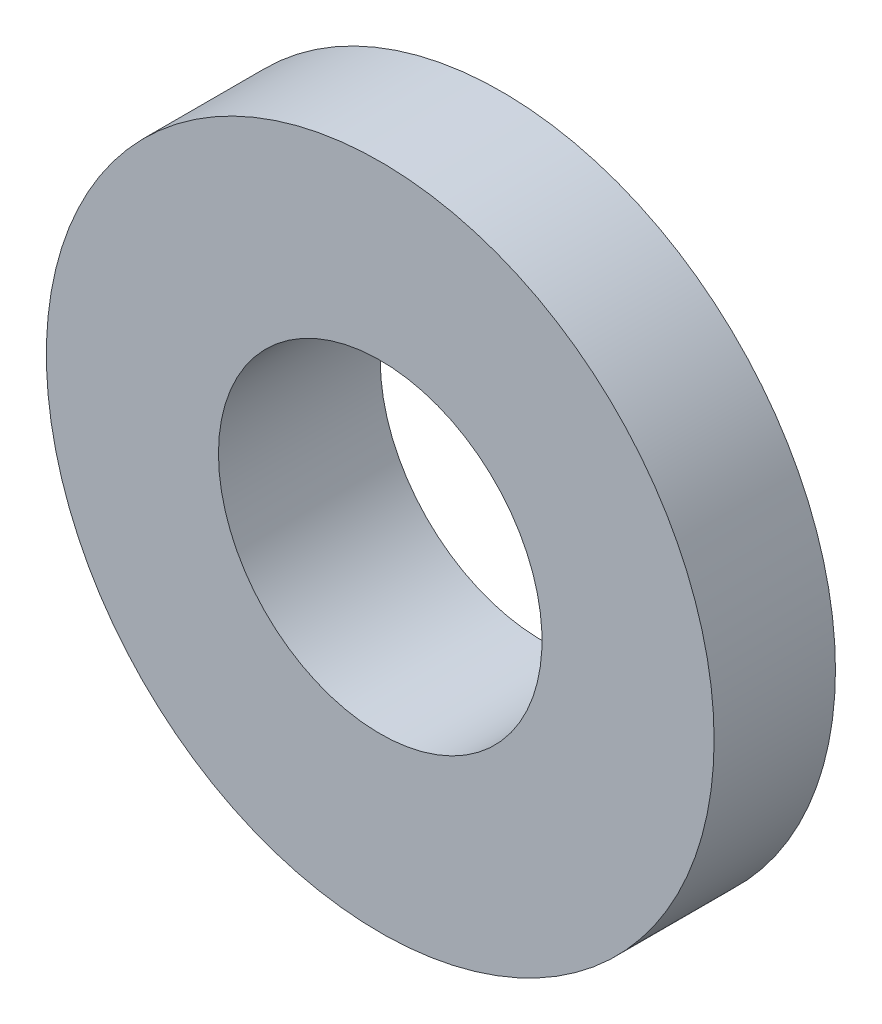
ISO-10303-21;
HEADER;
FILE_DESCRIPTION(('STEP AP214'),'2;1');
FILE_NAME('part.step','',(''),(''),'','','');
FILE_SCHEMA(('AUTOMOTIVE_DESIGN { 1 0 10303 214 1 1 1 1 }'));
ENDSEC;
DATA;
#1=APPLICATION_CONTEXT('core data for automotive mechanical design processes');
#2=APPLICATION_PROTOCOL_DEFINITION('international standard','automotive_design',2000,#1);
#3=PRODUCT_CONTEXT('',#1,'mechanical');
#4=PRODUCT('Part','Part','',(#3));
#5=PRODUCT_RELATED_PRODUCT_CATEGORY('part','',(#4));
#6=PRODUCT_DEFINITION_FORMATION('','',#4);
#7=PRODUCT_DEFINITION_CONTEXT('part definition',#1,'design');
#8=PRODUCT_DEFINITION('design','',#6,#7);
#9=PRODUCT_DEFINITION_SHAPE('','',#8);
#10=(LENGTH_UNIT() NAMED_UNIT(*) SI_UNIT(.MILLI.,.METRE.));
#11=(NAMED_UNIT(*) PLANE_ANGLE_UNIT() SI_UNIT($,.RADIAN.));
#12=(NAMED_UNIT(*) SI_UNIT($,.STERADIAN.) SOLID_ANGLE_UNIT());
#13=UNCERTAINTY_MEASURE_WITH_UNIT(LENGTH_MEASURE(1.E-05),#10,'distance_accuracy_value','');
#14=(GEOMETRIC_REPRESENTATION_CONTEXT(3) GLOBAL_UNCERTAINTY_ASSIGNED_CONTEXT((#13)) GLOBAL_UNIT_ASSIGNED_CONTEXT((#10,
#11,#12)) REPRESENTATION_CONTEXT('',''));
#15=CARTESIAN_POINT('',(0.,0.,0.));
#16=DIRECTION('',(0.,0.,1.));
#17=DIRECTION('',(1.,0.,0.));
#18=AXIS2_PLACEMENT_3D('',#15,#16,#17);
#19=CARTESIAN_POINT('',(0.,0.,3.));
#20=DIRECTION('',(0.,0.,-1.));
#21=DIRECTION('',(-1.,0.,0.));
#22=AXIS2_PLACEMENT_3D('',#19,#20,#21);
#23=CYLINDRICAL_SURFACE('',#22,8.25500000000001);
#24=CARTESIAN_POINT('',(0.,0.,3.));
#25=DIRECTION('',(0.,0.,1.));
#26=DIRECTION('',(1.,0.,0.));
#27=AXIS2_PLACEMENT_3D('',#24,#25,#26);
#28=CIRCLE('',#27,8.25500000000001);
#29=CARTESIAN_POINT('',(8.25500000000001,0.,3.));
#30=VERTEX_POINT('',#29);
#31=EDGE_CURVE('E45',#30,#30,#28,.T.);
#32=ORIENTED_EDGE('',*,*,#31,.F.);
#33=EDGE_LOOP('',(#32));
#34=FACE_BOUND('',#33,.T.);
#35=CARTESIAN_POINT('',(0.,0.,0.));
#36=DIRECTION('',(0.,0.,1.));
#37=DIRECTION('',(1.,0.,0.));
#38=AXIS2_PLACEMENT_3D('',#35,#36,#37);
#39=CIRCLE('',#38,8.25500000000001);
#40=CARTESIAN_POINT('',(8.25500000000001,0.,0.));
#41=VERTEX_POINT('',#40);
#42=EDGE_CURVE('E40',#41,#41,#39,.T.);
#43=ORIENTED_EDGE('',*,*,#42,.T.);
#44=EDGE_LOOP('',(#43));
#45=FACE_BOUND('',#44,.T.);
#46=ADVANCED_FACE('F37',(#34,#45),#23,.T.);
#47=CARTESIAN_POINT('',(0.,0.,3.));
#48=DIRECTION('',(0.,0.,1.));
#49=DIRECTION('',(1.,0.,0.));
#50=AXIS2_PLACEMENT_3D('',#47,#48,#49);
#51=PLANE('',#50);
#52=CARTESIAN_POINT('',(0.,0.,3.));
#53=DIRECTION('',(0.,0.,-1.));
#54=DIRECTION('',(-1.,0.,0.));
#55=AXIS2_PLACEMENT_3D('',#52,#53,#54);
#56=CIRCLE('',#55,4.);
#57=CARTESIAN_POINT('',(-4.,0.,3.));
#58=VERTEX_POINT('',#57);
#59=EDGE_CURVE('E56',#58,#58,#56,.T.);
#60=ORIENTED_EDGE('',*,*,#59,.T.);
#61=EDGE_LOOP('',(#60));
#62=FACE_BOUND('',#61,.T.);
#63=ORIENTED_EDGE('',*,*,#31,.T.);
#64=EDGE_LOOP('',(#63));
#65=FACE_BOUND('',#64,.T.);
#66=ADVANCED_FACE('F65',(#62,#65),#51,.T.);
#67=CARTESIAN_POINT('',(0.,0.,0.));
#68=DIRECTION('',(0.,0.,1.));
#69=DIRECTION('',(1.,0.,0.));
#70=AXIS2_PLACEMENT_3D('',#67,#68,#69);
#71=PLANE('',#70);
#72=CARTESIAN_POINT('',(0.,0.,0.));
#73=DIRECTION('',(0.,0.,-1.));
#74=DIRECTION('',(-1.,0.,0.));
#75=AXIS2_PLACEMENT_3D('',#72,#73,#74);
#76=CIRCLE('',#75,5.);
#77=CARTESIAN_POINT('',(-5.,0.,0.));
#78=VERTEX_POINT('',#77);
#79=EDGE_CURVE('E10',#78,#78,#76,.T.);
#80=ORIENTED_EDGE('',*,*,#79,.F.);
#81=EDGE_LOOP('',(#80));
#82=FACE_BOUND('',#81,.T.);
#83=ORIENTED_EDGE('',*,*,#42,.F.);
#84=EDGE_LOOP('',(#83));
#85=FACE_BOUND('',#84,.T.);
#86=ADVANCED_FACE('F82',(#82,#85),#71,.F.);
#87=CARTESIAN_POINT('',(0.,0.,-1.));
#88=DIRECTION('',(0.,0.,1.));
#89=DIRECTION('',(1.,0.,0.));
#90=AXIS2_PLACEMENT_3D('',#87,#88,#89);
#91=CYLINDRICAL_SURFACE('',#90,5.);
#92=CARTESIAN_POINT('',(0.,0.,-1.));
#93=DIRECTION('',(0.,0.,-1.));
#94=DIRECTION('',(-1.,0.,0.));
#95=AXIS2_PLACEMENT_3D('',#92,#93,#94);
#96=CIRCLE('',#95,5.);
#97=CARTESIAN_POINT('',(-5.,0.,-1.));
#98=VERTEX_POINT('',#97);
#99=EDGE_CURVE('E52',#98,#98,#96,.T.);
#100=ORIENTED_EDGE('',*,*,#99,.F.);
#101=EDGE_LOOP('',(#100));
#102=FACE_BOUND('',#101,.T.);
#103=ORIENTED_EDGE('',*,*,#79,.T.);
#104=EDGE_LOOP('',(#103));
#105=FACE_BOUND('',#104,.T.);
#106=ADVANCED_FACE('F77',(#102,#105),#91,.T.);
#107=CARTESIAN_POINT('',(0.,0.,-1.));
#108=DIRECTION('',(0.,0.,-1.));
#109=DIRECTION('',(-1.,0.,0.));
#110=AXIS2_PLACEMENT_3D('',#107,#108,#109);
#111=PLANE('',#110);
#112=CARTESIAN_POINT('',(0.,0.,-1.));
#113=DIRECTION('',(0.,0.,-1.));
#114=DIRECTION('',(-1.,0.,0.));
#115=AXIS2_PLACEMENT_3D('',#112,#113,#114);
#116=CIRCLE('',#115,4.);
#117=CARTESIAN_POINT('',(-4.,0.,-1.));
#118=VERTEX_POINT('',#117);
#119=EDGE_CURVE('E57',#118,#118,#116,.T.);
#120=ORIENTED_EDGE('',*,*,#119,.F.);
#121=EDGE_LOOP('',(#120));
#122=FACE_BOUND('',#121,.T.);
#123=ORIENTED_EDGE('',*,*,#99,.T.);
#124=EDGE_LOOP('',(#123));
#125=FACE_BOUND('',#124,.T.);
#126=ADVANCED_FACE('F71',(#122,#125),#111,.T.);
#127=CARTESIAN_POINT('',(0.,0.,3.));
#128=DIRECTION('',(0.,0.,-1.));
#129=DIRECTION('',(-1.,0.,0.));
#130=AXIS2_PLACEMENT_3D('',#127,#128,#129);
#131=CYLINDRICAL_SURFACE('',#130,4.);
#132=ORIENTED_EDGE('',*,*,#59,.F.);
#133=EDGE_LOOP('',(#132));
#134=FACE_BOUND('',#133,.T.);
#135=ORIENTED_EDGE('',*,*,#119,.T.);
#136=EDGE_LOOP('',(#135));
#137=FACE_BOUND('',#136,.T.);
#138=ADVANCED_FACE('F68',(#134,#137),#131,.F.);
#139=CLOSED_SHELL('',(#46,#66,#86,#106,#126,#138));
#140=MANIFOLD_SOLID_BREP('B2',#139);
#141=ADVANCED_BREP_SHAPE_REPRESENTATION('',(#18,#140),#14);
#142=SHAPE_DEFINITION_REPRESENTATION(#9,#141);
ENDSEC;
END-ISO-10303-21;
